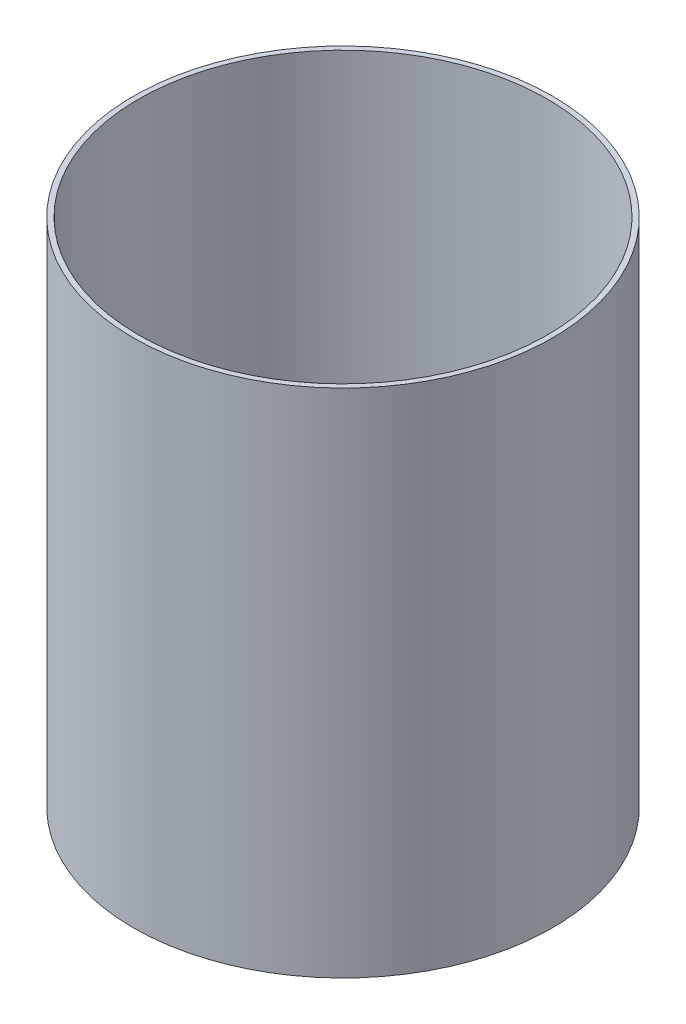
ISO-10303-21;
HEADER;
FILE_DESCRIPTION(('STEP AP214'),'2;1');
FILE_NAME('part.step','',(''),(''),'','','');
FILE_SCHEMA(('AUTOMOTIVE_DESIGN { 1 0 10303 214 1 1 1 1 }'));
ENDSEC;
DATA;
#1=APPLICATION_CONTEXT('core data for automotive mechanical design processes');
#2=APPLICATION_PROTOCOL_DEFINITION('international standard','automotive_design',2000,#1);
#3=PRODUCT_CONTEXT('',#1,'mechanical');
#4=PRODUCT('Part','Part','',(#3));
#5=PRODUCT_RELATED_PRODUCT_CATEGORY('part','',(#4));
#6=PRODUCT_DEFINITION_FORMATION('','',#4);
#7=PRODUCT_DEFINITION_CONTEXT('part definition',#1,'design');
#8=PRODUCT_DEFINITION('design','',#6,#7);
#9=PRODUCT_DEFINITION_SHAPE('','',#8);
#10=(LENGTH_UNIT() NAMED_UNIT(*) SI_UNIT(.MILLI.,.METRE.));
#11=(NAMED_UNIT(*) PLANE_ANGLE_UNIT() SI_UNIT($,.RADIAN.));
#12=(NAMED_UNIT(*) SI_UNIT($,.STERADIAN.) SOLID_ANGLE_UNIT());
#13=UNCERTAINTY_MEASURE_WITH_UNIT(LENGTH_MEASURE(1.E-05),#10,'distance_accuracy_value','');
#14=(GEOMETRIC_REPRESENTATION_CONTEXT(3) GLOBAL_UNCERTAINTY_ASSIGNED_CONTEXT((#13)) GLOBAL_UNIT_ASSIGNED_CONTEXT((#10,
#11,#12)) REPRESENTATION_CONTEXT('',''));
#15=CARTESIAN_POINT('',(0.,0.,0.));
#16=DIRECTION('',(0.,0.,1.));
#17=DIRECTION('',(1.,0.,0.));
#18=AXIS2_PLACEMENT_3D('',#15,#16,#17);
#19=CARTESIAN_POINT('',(0.,250.,0.));
#20=DIRECTION('',(0.,1.,0.));
#21=DIRECTION('',(0.,0.,1.));
#22=AXIS2_PLACEMENT_3D('',#19,#20,#21);
#23=PLANE('',#22);
#24=CARTESIAN_POINT('',(0.,250.,0.));
#25=DIRECTION('',(0.,1.,0.));
#26=DIRECTION('',(0.,0.,1.));
#27=AXIS2_PLACEMENT_3D('',#24,#25,#26);
#28=CIRCLE('',#27,102.5);
#29=CARTESIAN_POINT('',(0.,250.,102.5));
#30=VERTEX_POINT('',#29);
#31=EDGE_CURVE('E10',#30,#30,#28,.T.);
#32=ORIENTED_EDGE('',*,*,#31,.T.);
#33=EDGE_LOOP('',(#32));
#34=FACE_BOUND('',#33,.T.);
#35=CARTESIAN_POINT('',(0.,250.,0.));
#36=DIRECTION('',(0.,1.,0.));
#37=DIRECTION('',(0.,0.,1.));
#38=AXIS2_PLACEMENT_3D('',#35,#36,#37);
#39=CIRCLE('',#38,100.);
#40=CARTESIAN_POINT('',(0.,250.,100.));
#41=VERTEX_POINT('',#40);
#42=EDGE_CURVE('E42',#41,#41,#39,.T.);
#43=ORIENTED_EDGE('',*,*,#42,.F.);
#44=EDGE_LOOP('',(#43));
#45=FACE_BOUND('',#44,.T.);
#46=ADVANCED_FACE('F31',(#34,#45),#23,.T.);
#47=CARTESIAN_POINT('',(0.,0.,0.));
#48=DIRECTION('',(0.,1.,0.));
#49=DIRECTION('',(0.,0.,1.));
#50=AXIS2_PLACEMENT_3D('',#47,#48,#49);
#51=PLANE('',#50);
#52=CARTESIAN_POINT('',(0.,0.,0.));
#53=DIRECTION('',(0.,1.,0.));
#54=DIRECTION('',(0.,0.,1.));
#55=AXIS2_PLACEMENT_3D('',#52,#53,#54);
#56=CIRCLE('',#55,102.5);
#57=CARTESIAN_POINT('',(0.,0.,102.5));
#58=VERTEX_POINT('',#57);
#59=EDGE_CURVE('E35',#58,#58,#56,.T.);
#60=ORIENTED_EDGE('',*,*,#59,.F.);
#61=EDGE_LOOP('',(#60));
#62=FACE_BOUND('',#61,.T.);
#63=CARTESIAN_POINT('',(0.,0.,0.));
#64=DIRECTION('',(0.,1.,0.));
#65=DIRECTION('',(0.,0.,1.));
#66=AXIS2_PLACEMENT_3D('',#63,#64,#65);
#67=CIRCLE('',#66,100.);
#68=CARTESIAN_POINT('',(0.,0.,100.));
#69=VERTEX_POINT('',#68);
#70=EDGE_CURVE('E44',#69,#69,#67,.T.);
#71=ORIENTED_EDGE('',*,*,#70,.T.);
#72=EDGE_LOOP('',(#71));
#73=FACE_BOUND('',#72,.T.);
#74=ADVANCED_FACE('F54',(#62,#73),#51,.F.);
#75=CARTESIAN_POINT('',(0.,250.,0.));
#76=DIRECTION('',(0.,-1.,0.));
#77=DIRECTION('',(0.,0.,-1.));
#78=AXIS2_PLACEMENT_3D('',#75,#76,#77);
#79=CYLINDRICAL_SURFACE('',#78,102.5);
#80=ORIENTED_EDGE('',*,*,#31,.F.);
#81=EDGE_LOOP('',(#80));
#82=FACE_BOUND('',#81,.T.);
#83=ORIENTED_EDGE('',*,*,#59,.T.);
#84=EDGE_LOOP('',(#83));
#85=FACE_BOUND('',#84,.T.);
#86=ADVANCED_FACE('F33',(#82,#85),#79,.T.);
#87=CARTESIAN_POINT('',(0.,250.,0.));
#88=DIRECTION('',(0.,-1.,0.));
#89=DIRECTION('',(0.,0.,-1.));
#90=AXIS2_PLACEMENT_3D('',#87,#88,#89);
#91=CYLINDRICAL_SURFACE('',#90,100.);
#92=ORIENTED_EDGE('',*,*,#42,.T.);
#93=EDGE_LOOP('',(#92));
#94=FACE_BOUND('',#93,.T.);
#95=ORIENTED_EDGE('',*,*,#70,.F.);
#96=EDGE_LOOP('',(#95));
#97=FACE_BOUND('',#96,.T.);
#98=ADVANCED_FACE('F50',(#94,#97),#91,.F.);
#99=CLOSED_SHELL('',(#46,#74,#86,#98));
#100=MANIFOLD_SOLID_BREP('B2',#99);
#101=ADVANCED_BREP_SHAPE_REPRESENTATION('',(#18,#100),#14);
#102=SHAPE_DEFINITION_REPRESENTATION(#9,#101);
ENDSEC;
END-ISO-10303-21;
